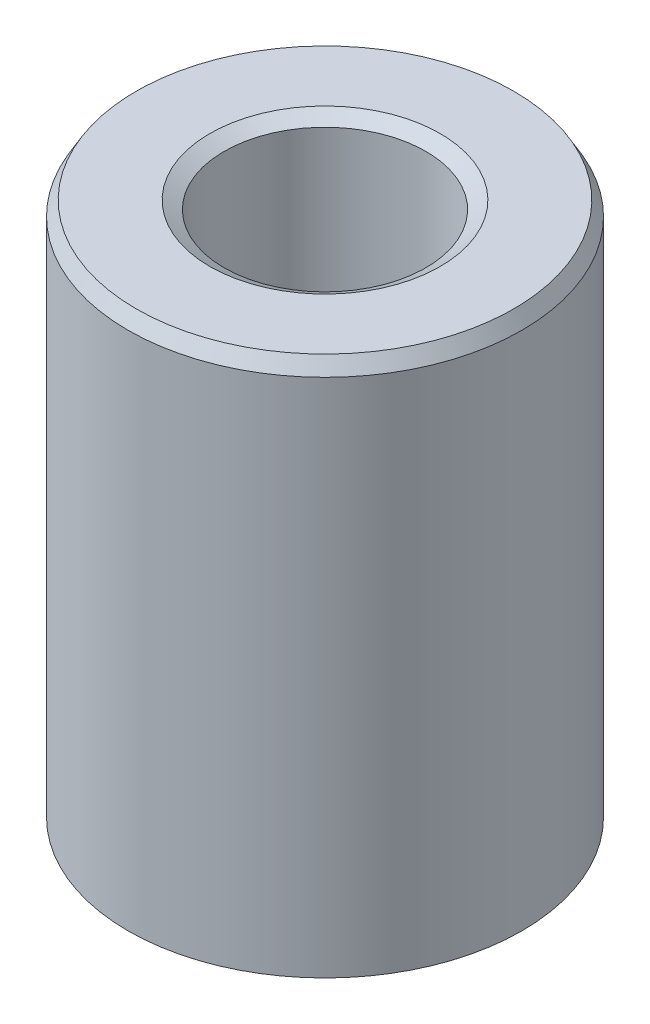
ISO-10303-21;
HEADER;
FILE_DESCRIPTION(('STEP AP214'),'2;1');
FILE_NAME('part.step','',(''),(''),'','','');
FILE_SCHEMA(('AUTOMOTIVE_DESIGN { 1 0 10303 214 1 1 1 1 }'));
ENDSEC;
DATA;
#1=APPLICATION_CONTEXT('core data for automotive mechanical design processes');
#2=APPLICATION_PROTOCOL_DEFINITION('international standard','automotive_design',2000,#1);
#3=PRODUCT_CONTEXT('',#1,'mechanical');
#4=PRODUCT('Part','Part','',(#3));
#5=PRODUCT_RELATED_PRODUCT_CATEGORY('part','',(#4));
#6=PRODUCT_DEFINITION_FORMATION('','',#4);
#7=PRODUCT_DEFINITION_CONTEXT('part definition',#1,'design');
#8=PRODUCT_DEFINITION('design','',#6,#7);
#9=PRODUCT_DEFINITION_SHAPE('','',#8);
#10=(LENGTH_UNIT() NAMED_UNIT(*) SI_UNIT(.MILLI.,.METRE.));
#11=(NAMED_UNIT(*) PLANE_ANGLE_UNIT() SI_UNIT($,.RADIAN.));
#12=(NAMED_UNIT(*) SI_UNIT($,.STERADIAN.) SOLID_ANGLE_UNIT());
#13=UNCERTAINTY_MEASURE_WITH_UNIT(LENGTH_MEASURE(1.E-05),#10,'distance_accuracy_value','');
#14=(GEOMETRIC_REPRESENTATION_CONTEXT(3) GLOBAL_UNCERTAINTY_ASSIGNED_CONTEXT((#13)) GLOBAL_UNIT_ASSIGNED_CONTEXT((#10,
#11,#12)) REPRESENTATION_CONTEXT('',''));
#15=CARTESIAN_POINT('',(0.,0.,0.));
#16=DIRECTION('',(0.,0.,1.));
#17=DIRECTION('',(1.,0.,0.));
#18=AXIS2_PLACEMENT_3D('',#15,#16,#17);
#19=CARTESIAN_POINT('',(0.,110.235664164509,0.));
#20=DIRECTION('',(0.,-1.,0.));
#21=DIRECTION('',(0.,0.,-1.));
#22=AXIS2_PLACEMENT_3D('',#19,#20,#21);
#23=CYLINDRICAL_SURFACE('',#22,40.);
#24=CARTESIAN_POINT('',(0.,1.67950215131411,0.));
#25=DIRECTION('',(0.,1.,0.));
#26=DIRECTION('',(0.,0.,1.));
#27=AXIS2_PLACEMENT_3D('',#24,#25,#26);
#28=CIRCLE('',#27,40.);
#29=CARTESIAN_POINT('',(0.,1.67950215131411,40.));
#30=VERTEX_POINT('',#29);
#31=EDGE_CURVE('E10',#30,#30,#28,.T.);
#32=ORIENTED_EDGE('',*,*,#31,.T.);
#33=EDGE_LOOP('',(#32));
#34=FACE_BOUND('',#33,.T.);
#35=CARTESIAN_POINT('',(0.,107.326681107011,0.));
#36=DIRECTION('',(0.,1.,0.));
#37=DIRECTION('',(0.,0.,1.));
#38=AXIS2_PLACEMENT_3D('',#35,#36,#37);
#39=CIRCLE('',#38,40.);
#40=CARTESIAN_POINT('',(0.,107.326681107011,-40.));
#41=VERTEX_POINT('',#40);
#42=EDGE_CURVE('E50',#41,#41,#39,.F.);
#43=ORIENTED_EDGE('',*,*,#42,.T.);
#44=EDGE_LOOP('',(#43));
#45=FACE_BOUND('',#44,.T.);
#46=ADVANCED_FACE('F39',(#34,#45),#23,.T.);
#47=CARTESIAN_POINT('',(0.,110.235664164509,0.));
#48=DIRECTION('',(0.,1.,0.));
#49=DIRECTION('',(0.,0.,1.));
#50=AXIS2_PLACEMENT_3D('',#47,#48,#49);
#51=PLANE('',#50);
#52=CARTESIAN_POINT('',(0.,110.235664164509,0.));
#53=DIRECTION('',(0.,1.,0.));
#54=DIRECTION('',(0.,0.,1.));
#55=AXIS2_PLACEMENT_3D('',#52,#53,#54);
#56=CIRCLE('',#55,23.3950100797519);
#57=CARTESIAN_POINT('',(0.,110.235664164509,23.3950100797519));
#58=VERTEX_POINT('',#57);
#59=EDGE_CURVE('E58',#58,#58,#56,.F.);
#60=ORIENTED_EDGE('',*,*,#59,.T.);
#61=EDGE_LOOP('',(#60));
#62=FACE_BOUND('',#61,.T.);
#63=CARTESIAN_POINT('',(0.,110.235664164509,0.));
#64=DIRECTION('',(0.,1.,0.));
#65=DIRECTION('',(0.,0.,1.));
#66=AXIS2_PLACEMENT_3D('',#63,#64,#65);
#67=CIRCLE('',#66,38.3204978486859);
#68=CARTESIAN_POINT('',(0.,110.235664164509,-38.3204978486859));
#69=VERTEX_POINT('',#68);
#70=EDGE_CURVE('E61',#69,#69,#67,.T.);
#71=ORIENTED_EDGE('',*,*,#70,.T.);
#72=EDGE_LOOP('',(#71));
#73=FACE_BOUND('',#72,.T.);
#74=ADVANCED_FACE('F88',(#62,#73),#51,.T.);
#75=CARTESIAN_POINT('',(0.,0.,0.));
#76=DIRECTION('',(0.,1.,0.));
#77=DIRECTION('',(0.,0.,1.));
#78=AXIS2_PLACEMENT_3D('',#75,#76,#77);
#79=PLANE('',#78);
#80=CARTESIAN_POINT('',(0.,0.,0.));
#81=DIRECTION('',(0.,1.,0.));
#82=DIRECTION('',(0.,0.,1.));
#83=AXIS2_PLACEMENT_3D('',#80,#81,#82);
#84=CIRCLE('',#83,22.1655291735687);
#85=CARTESIAN_POINT('',(0.,0.,22.1655291735687));
#86=VERTEX_POINT('',#85);
#87=EDGE_CURVE('E51',#86,#86,#84,.T.);
#88=ORIENTED_EDGE('',*,*,#87,.T.);
#89=EDGE_LOOP('',(#88));
#90=FACE_BOUND('',#89,.T.);
#91=CARTESIAN_POINT('',(0.,0.,0.));
#92=DIRECTION('',(0.,1.,0.));
#93=DIRECTION('',(0.,0.,1.));
#94=AXIS2_PLACEMENT_3D('',#91,#92,#93);
#95=CIRCLE('',#94,37.0910169425027);
#96=CARTESIAN_POINT('',(0.,0.,37.0910169425027));
#97=VERTEX_POINT('',#96);
#98=EDGE_CURVE('E54',#97,#97,#95,.F.);
#99=ORIENTED_EDGE('',*,*,#98,.T.);
#100=EDGE_LOOP('',(#99));
#101=FACE_BOUND('',#100,.T.);
#102=ADVANCED_FACE('F83',(#90,#101),#79,.F.);
#103=CARTESIAN_POINT('',(0.,110.235664164509,0.));
#104=DIRECTION('',(0.,-1.,0.));
#105=DIRECTION('',(0.,0.,-1.));
#106=AXIS2_PLACEMENT_3D('',#103,#104,#105);
#107=CYLINDRICAL_SURFACE('',#106,20.4860270222546);
#108=CARTESIAN_POINT('',(0.,108.556162013195,0.));
#109=DIRECTION('',(0.,1.,0.));
#110=DIRECTION('',(0.,0.,1.));
#111=AXIS2_PLACEMENT_3D('',#108,#109,#110);
#112=CIRCLE('',#111,20.4860270222546);
#113=CARTESIAN_POINT('',(0.,108.556162013195,20.4860270222546));
#114=VERTEX_POINT('',#113);
#115=EDGE_CURVE('E67',#114,#114,#112,.T.);
#116=ORIENTED_EDGE('',*,*,#115,.T.);
#117=EDGE_LOOP('',(#116));
#118=FACE_BOUND('',#117,.T.);
#119=CARTESIAN_POINT('',(0.,2.9089830574973,0.));
#120=DIRECTION('',(0.,1.,0.));
#121=DIRECTION('',(0.,0.,1.));
#122=AXIS2_PLACEMENT_3D('',#119,#120,#121);
#123=CIRCLE('',#122,20.4860270222546);
#124=CARTESIAN_POINT('',(0.,2.9089830574973,20.4860270222546));
#125=VERTEX_POINT('',#124);
#126=EDGE_CURVE('E69',#125,#125,#123,.F.);
#127=ORIENTED_EDGE('',*,*,#126,.T.);
#128=EDGE_LOOP('',(#127));
#129=FACE_BOUND('',#128,.T.);
#130=ADVANCED_FACE('F71',(#118,#129),#107,.F.);
#131=CARTESIAN_POINT('',(0.,108.556162013195,0.));
#132=DIRECTION('',(0.,1.,0.));
#133=DIRECTION('',(0.,0.,1.));
#134=AXIS2_PLACEMENT_3D('',#131,#132,#133);
#135=CONICAL_SURFACE('',#134,20.4860270222546,1.0471975511966);
#136=ORIENTED_EDGE('',*,*,#59,.F.);
#137=EDGE_LOOP('',(#136));
#138=FACE_BOUND('',#137,.T.);
#139=ORIENTED_EDGE('',*,*,#115,.F.);
#140=EDGE_LOOP('',(#139));
#141=FACE_BOUND('',#140,.T.);
#142=ADVANCED_FACE('F77',(#138,#141),#135,.F.);
#143=CARTESIAN_POINT('',(0.,0.,0.));
#144=DIRECTION('',(0.,-1.,0.));
#145=DIRECTION('',(0.,0.,-1.));
#146=AXIS2_PLACEMENT_3D('',#143,#144,#145);
#147=CONICAL_SURFACE('',#146,22.1655291735687,0.523598775598297);
#148=ORIENTED_EDGE('',*,*,#126,.F.);
#149=EDGE_LOOP('',(#148));
#150=FACE_BOUND('',#149,.T.);
#151=ORIENTED_EDGE('',*,*,#87,.F.);
#152=EDGE_LOOP('',(#151));
#153=FACE_BOUND('',#152,.T.);
#154=ADVANCED_FACE('F73',(#150,#153),#147,.F.);
#155=CARTESIAN_POINT('',(0.,1.67950215131411,0.));
#156=DIRECTION('',(0.,1.,0.));
#157=DIRECTION('',(0.,0.,1.));
#158=AXIS2_PLACEMENT_3D('',#155,#156,#157);
#159=CONICAL_SURFACE('',#158,40.,1.0471975511966);
#160=ORIENTED_EDGE('',*,*,#98,.F.);
#161=EDGE_LOOP('',(#160));
#162=FACE_BOUND('',#161,.T.);
#163=ORIENTED_EDGE('',*,*,#31,.F.);
#164=EDGE_LOOP('',(#163));
#165=FACE_BOUND('',#164,.T.);
#166=ADVANCED_FACE('F76',(#162,#165),#159,.T.);
#167=CARTESIAN_POINT('',(0.,110.235664164509,0.));
#168=DIRECTION('',(0.,-1.,0.));
#169=DIRECTION('',(0.,0.,-1.));
#170=AXIS2_PLACEMENT_3D('',#167,#168,#169);
#171=CONICAL_SURFACE('',#170,38.3204978486859,0.523598775598296);
#172=CARTESIAN_POINT('',(0.,107.326681107011,-40.));
#173=CARTESIAN_POINT('',(0.,107.35698301386,-39.9825051859238));
#174=CARTESIAN_POINT('',(0.,107.387284920709,-39.9650103718476));
#175=CARTESIAN_POINT('',(0.,107.447888734407,-39.9300207436952));
#176=CARTESIAN_POINT('',(0.,107.478190641256,-39.9125259296191));
#177=CARTESIAN_POINT('',(0.,107.538794454954,-39.8775363014667));
#178=CARTESIAN_POINT('',(0.,107.569096361803,-39.8600414873905));
#179=CARTESIAN_POINT('',(0.,107.629700175501,-39.8250518592381));
#180=CARTESIAN_POINT('',(0.,107.66000208235,-39.8075570451619));
#181=CARTESIAN_POINT('',(0.,107.720605896048,-39.7725674170095));
#182=CARTESIAN_POINT('',(0.,107.750907802896,-39.7550726029334));
#183=CARTESIAN_POINT('',(0.,107.811511616594,-39.720082974781));
#184=CARTESIAN_POINT('',(0.,107.841813523443,-39.7025881607048));
#185=CARTESIAN_POINT('',(0.,107.902417337141,-39.6675985325524));
#186=CARTESIAN_POINT('',(0.,107.93271924399,-39.6501037184762));
#187=CARTESIAN_POINT('',(0.,107.993323057688,-39.6151140903238));
#188=CARTESIAN_POINT('',(0.,108.023624964537,-39.5976192762477));
#189=CARTESIAN_POINT('',(0.,108.084228778235,-39.5626296480953));
#190=CARTESIAN_POINT('',(0.,108.114530685084,-39.5451348340191));
#191=CARTESIAN_POINT('',(0.,108.175134498782,-39.5101452058667));
#192=CARTESIAN_POINT('',(0.,108.20543640563,-39.4926503917905));
#193=CARTESIAN_POINT('',(0.,108.266040219328,-39.4576607636381));
#194=CARTESIAN_POINT('',(0.,108.296342126177,-39.440165949562));
#195=CARTESIAN_POINT('',(0.,108.356945939875,-39.4051763214096));
#196=CARTESIAN_POINT('',(0.,108.387247846724,-39.3876815073334));
#197=CARTESIAN_POINT('',(0.,108.447851660422,-39.352691879181));
#198=CARTESIAN_POINT('',(0.,108.478153567271,-39.3351970651048));
#199=CARTESIAN_POINT('',(0.,108.538757380969,-39.3002074369524));
#200=CARTESIAN_POINT('',(0.,108.569059287818,-39.2827126228763));
#201=CARTESIAN_POINT('',(0.,108.629663101515,-39.2477229947239));
#202=CARTESIAN_POINT('',(0.,108.659965008364,-39.2302281806477));
#203=CARTESIAN_POINT('',(0.,108.720568822062,-39.1952385524953));
#204=CARTESIAN_POINT('',(0.,108.750870728911,-39.1777437384191));
#205=CARTESIAN_POINT('',(0.,108.811474542609,-39.1427541102667));
#206=CARTESIAN_POINT('',(0.,108.841776449458,-39.1252592961906));
#207=CARTESIAN_POINT('',(0.,108.902380263156,-39.0902696680382));
#208=CARTESIAN_POINT('',(0.,108.932682170005,-39.072774853962));
#209=CARTESIAN_POINT('',(0.,108.993285983703,-39.0377852258096));
#210=CARTESIAN_POINT('',(0.,109.023587890552,-39.0202904117334));
#211=CARTESIAN_POINT('',(0.,109.084191704249,-38.985300783581));
#212=CARTESIAN_POINT('',(0.,109.114493611098,-38.9678059695049));
#213=CARTESIAN_POINT('',(0.,109.175097424796,-38.9328163413525));
#214=CARTESIAN_POINT('',(0.,109.205399331645,-38.9153215272763));
#215=CARTESIAN_POINT('',(0.,109.266003145343,-38.8803318991239));
#216=CARTESIAN_POINT('',(0.,109.296305052192,-38.8628370850477));
#217=CARTESIAN_POINT('',(0.,109.35690886589,-38.8278474568953));
#218=CARTESIAN_POINT('',(0.,109.387210772739,-38.8103526428192));
#219=CARTESIAN_POINT('',(0.,109.447814586437,-38.7753630146668));
#220=CARTESIAN_POINT('',(0.,109.478116493286,-38.7578682005906));
#221=CARTESIAN_POINT('',(0.,109.538720306983,-38.7228785724382));
#222=CARTESIAN_POINT('',(0.,109.569022213832,-38.705383758362));
#223=CARTESIAN_POINT('',(0.,109.62962602753,-38.6703941302096));
#224=CARTESIAN_POINT('',(0.,109.659927934379,-38.6528993161334));
#225=CARTESIAN_POINT('',(0.,109.720531748077,-38.6179096879811));
#226=CARTESIAN_POINT('',(0.,109.750833654926,-38.6004148739049));
#227=CARTESIAN_POINT('',(0.,109.811437468624,-38.5654252457525));
#228=CARTESIAN_POINT('',(0.,109.841739375473,-38.5479304316763));
#229=CARTESIAN_POINT('',(0.,109.902343189171,-38.5129408035239));
#230=CARTESIAN_POINT('',(0.,109.93264509602,-38.4954459894478));
#231=CARTESIAN_POINT('',(0.,109.993248909717,-38.4604563612954));
#232=CARTESIAN_POINT('',(0.,110.023550816566,-38.4429615472192));
#233=CARTESIAN_POINT('',(0.,110.084154630264,-38.4079719190668));
#234=CARTESIAN_POINT('',(0.,110.114456537113,-38.3904771049906));
#235=CARTESIAN_POINT('',(0.,110.175060350811,-38.3554874768382));
#236=CARTESIAN_POINT('',(0.,110.20536225766,-38.337992662762));
#237=CARTESIAN_POINT('',(0.,110.235664164509,-38.3204978486859));
#238=B_SPLINE_CURVE_WITH_KNOTS('',3,(#172,#173,#174,#175,#176,#177,#178,#179,#180,#181,#182,
#183,#184,#185,#186,#187,#188,#189,#190,#191,#192,#193,#194,#195,#196,#197,#198,#199,#200,#201,
#202,#203,#204,#205,#206,#207,#208,#209,#210,#211,#212,#213,#214,#215,#216,#217,#218,#219,#220,
#221,#222,#223,#224,#225,#226,#227,#228,#229,#230,#231,#232,#233,#234,#235,#236,#237),
.UNSPECIFIED.,.F.,.F.,(4,2,2,2,2,2,2,2,2,2,2,2,2,2,2,2,2,2,2,2,2,2,2,2,2,2,2,2,2,2,2,2,4),(0.,
0.104968884457148,0.20993776891428,0.314906653371413,0.419875537828549,0.524844422285682,
0.629813306742814,0.73478219119995,0.839751075657083,0.944719960114219,1.04968884457135,
1.15465772902848,1.25962661348563,1.36459549794276,1.4695643823999,1.57453326685703,
1.67950215131417,1.7844710357713,1.88943992022843,1.99440880468557,2.0993776891427,
2.20434657359983,2.30931545805698,2.41428434251411,2.51925322697125,2.62422211142838,
2.72919099588551,2.83415988034265,2.93912876479978,3.04409764925691,3.14906653371405,
3.25403541817118,3.35900430262833),.UNSPECIFIED.);
#239=EDGE_CURVE('BSEAM45',#41,#69,#238,.T.);
#240=ORIENTED_EDGE('',*,*,#42,.F.);
#241=ORIENTED_EDGE('',*,*,#70,.F.);
#242=ORIENTED_EDGE('',*,*,#239,.T.);
#243=ORIENTED_EDGE('',*,*,#239,.F.);
#244=EDGE_LOOP('',(#240,#242,#241,#243));
#245=FACE_BOUND('',#244,.T.);
#246=ADVANCED_FACE('F45',(#245),#171,.T.);
#247=CLOSED_SHELL('',(#46,#74,#102,#130,#142,#154,#166,#246));
#248=MANIFOLD_SOLID_BREP('B2',#247);
#249=ADVANCED_BREP_SHAPE_REPRESENTATION('',(#18,#248),#14);
#250=SHAPE_DEFINITION_REPRESENTATION(#9,#249);
ENDSEC;
END-ISO-10303-21;
